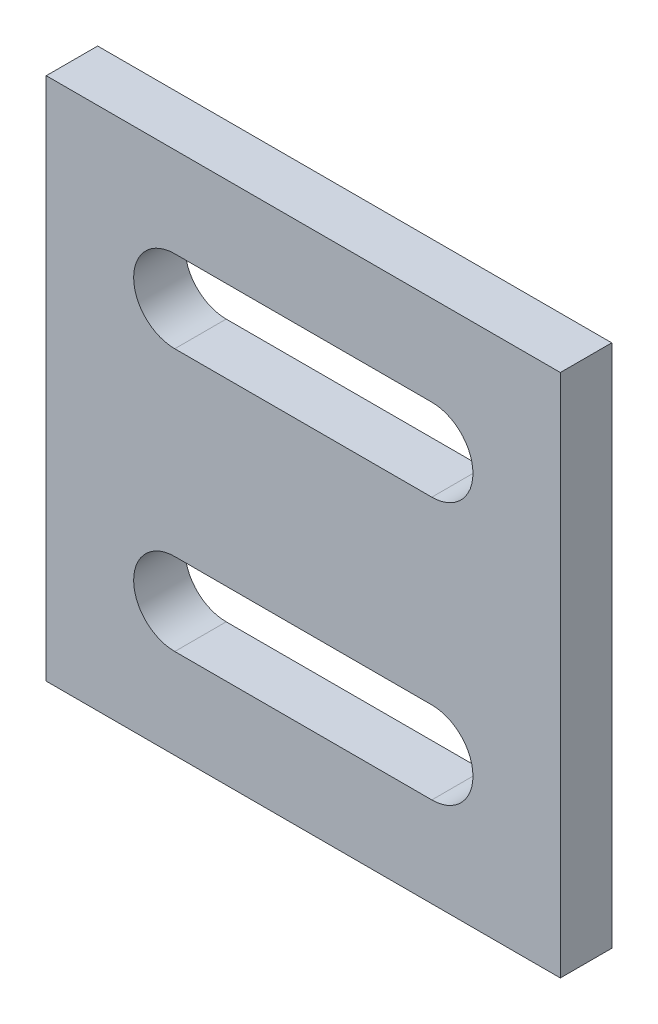
ISO-10303-21;
HEADER;
FILE_DESCRIPTION(('STEP AP214'),'2;1');
FILE_NAME('part.step','',(''),(''),'','','');
FILE_SCHEMA(('AUTOMOTIVE_DESIGN { 1 0 10303 214 1 1 1 1 }'));
ENDSEC;
DATA;
#1=APPLICATION_CONTEXT('core data for automotive mechanical design processes');
#2=APPLICATION_PROTOCOL_DEFINITION('international standard','automotive_design',2000,#1);
#3=PRODUCT_CONTEXT('',#1,'mechanical');
#4=PRODUCT('Part','Part','',(#3));
#5=PRODUCT_RELATED_PRODUCT_CATEGORY('part','',(#4));
#6=PRODUCT_DEFINITION_FORMATION('','',#4);
#7=PRODUCT_DEFINITION_CONTEXT('part definition',#1,'design');
#8=PRODUCT_DEFINITION('design','',#6,#7);
#9=PRODUCT_DEFINITION_SHAPE('','',#8);
#10=(LENGTH_UNIT() NAMED_UNIT(*) SI_UNIT(.MILLI.,.METRE.));
#11=(NAMED_UNIT(*) PLANE_ANGLE_UNIT() SI_UNIT($,.RADIAN.));
#12=(NAMED_UNIT(*) SI_UNIT($,.STERADIAN.) SOLID_ANGLE_UNIT());
#13=UNCERTAINTY_MEASURE_WITH_UNIT(LENGTH_MEASURE(1.E-05),#10,'distance_accuracy_value','');
#14=(GEOMETRIC_REPRESENTATION_CONTEXT(3) GLOBAL_UNCERTAINTY_ASSIGNED_CONTEXT((#13)) GLOBAL_UNIT_ASSIGNED_CONTEXT((#10,
#11,#12)) REPRESENTATION_CONTEXT('',''));
#15=CARTESIAN_POINT('',(0.,0.,0.));
#16=DIRECTION('',(0.,0.,1.));
#17=DIRECTION('',(1.,0.,0.));
#18=AXIS2_PLACEMENT_3D('',#15,#16,#17);
#19=CARTESIAN_POINT('',(0.,0.,2.));
#20=DIRECTION('',(0.,0.,1.));
#21=DIRECTION('',(1.,0.,0.));
#22=AXIS2_PLACEMENT_3D('',#19,#20,#21);
#23=PLANE('',#22);
#24=DIRECTION('',(0.,-1.,0.));
#25=VECTOR('',#24,1.);
#26=CARTESIAN_POINT('',(-18.1755180011164,18.3409622952862,2.));
#27=LINE('',#26,#25);
#28=CARTESIAN_POINT('',(-18.1755180011164,18.3409622952862,2.));
#29=VERTEX_POINT('',#28);
#30=CARTESIAN_POINT('',(-18.1755180011164,-2.05903770471384,2.));
#31=VERTEX_POINT('',#30);
#32=EDGE_CURVE('E224',#29,#31,#27,.T.);
#33=ORIENTED_EDGE('',*,*,#32,.T.);
#34=DIRECTION('',(1.,0.,0.));
#35=VECTOR('',#34,1.);
#36=CARTESIAN_POINT('',(-18.1755180011164,-2.05903770471384,2.));
#37=LINE('',#36,#35);
#38=CARTESIAN_POINT('',(1.82448199888361,-2.05903770471383,2.));
#39=VERTEX_POINT('',#38);
#40=EDGE_CURVE('E228',#31,#39,#37,.T.);
#41=ORIENTED_EDGE('',*,*,#40,.T.);
#42=DIRECTION('',(0.,1.,0.));
#43=VECTOR('',#42,1.);
#44=CARTESIAN_POINT('',(1.82448199888361,18.3409622952862,2.));
#45=LINE('',#44,#43);
#46=CARTESIAN_POINT('',(1.82448199888361,18.3409622952862,2.));
#47=VERTEX_POINT('',#46);
#48=EDGE_CURVE('E232',#39,#47,#45,.T.);
#49=ORIENTED_EDGE('',*,*,#48,.T.);
#50=DIRECTION('',(-1.,0.,0.));
#51=VECTOR('',#50,1.);
#52=CARTESIAN_POINT('',(-18.1755180011164,18.3409622952862,2.));
#53=LINE('',#52,#51);
#54=EDGE_CURVE('E235',#47,#29,#53,.T.);
#55=ORIENTED_EDGE('',*,*,#54,.T.);
#56=EDGE_LOOP('',(#33,#41,#49,#55));
#57=FACE_BOUND('',#56,.T.);
#58=DIRECTION('',(1.,0.,0.));
#59=VECTOR('',#58,1.);
#60=CARTESIAN_POINT('',(-13.1755180011164,11.6409622952862,2.));
#61=LINE('',#60,#59);
#62=CARTESIAN_POINT('',(-13.1755180011164,11.6409622952862,2.));
#63=VERTEX_POINT('',#62);
#64=CARTESIAN_POINT('',(-3.17551800111639,11.6409622952862,2.));
#65=VERTEX_POINT('',#64);
#66=EDGE_CURVE('E184',#63,#65,#61,.T.);
#67=ORIENTED_EDGE('',*,*,#66,.F.);
#68=CARTESIAN_POINT('',(-13.1755180011164,13.2409622952862,2.));
#69=DIRECTION('',(0.,0.,1.));
#70=DIRECTION('',(1.,0.,0.));
#71=AXIS2_PLACEMENT_3D('',#68,#69,#70);
#72=CIRCLE('',#71,1.6);
#73=CARTESIAN_POINT('',(-13.1755180011164,14.8409622952862,2.));
#74=VERTEX_POINT('',#73);
#75=EDGE_CURVE('E181',#74,#63,#72,.T.);
#76=ORIENTED_EDGE('',*,*,#75,.F.);
#77=DIRECTION('',(-1.,0.,0.));
#78=VECTOR('',#77,1.);
#79=CARTESIAN_POINT('',(-13.1755180011164,14.8409622952862,2.));
#80=LINE('',#79,#78);
#81=CARTESIAN_POINT('',(-3.17551800111639,14.8409622952862,2.));
#82=VERTEX_POINT('',#81);
#83=EDGE_CURVE('E192',#82,#74,#80,.T.);
#84=ORIENTED_EDGE('',*,*,#83,.F.);
#85=CARTESIAN_POINT('',(-3.17551800111639,13.2409622952862,2.));
#86=DIRECTION('',(0.,0.,1.));
#87=DIRECTION('',(1.,0.,0.));
#88=AXIS2_PLACEMENT_3D('',#85,#86,#87);
#89=CIRCLE('',#88,1.6);
#90=EDGE_CURVE('E188',#65,#82,#89,.T.);
#91=ORIENTED_EDGE('',*,*,#90,.F.);
#92=EDGE_LOOP('',(#67,#76,#84,#91));
#93=FACE_BOUND('',#92,.T.);
#94=DIRECTION('',(1.,0.,0.));
#95=VECTOR('',#94,1.);
#96=CARTESIAN_POINT('',(-13.1755180011164,1.44096229528616,2.));
#97=LINE('',#96,#95);
#98=CARTESIAN_POINT('',(-13.1755180011164,1.44096229528616,2.));
#99=VERTEX_POINT('',#98);
#100=CARTESIAN_POINT('',(-3.17551800111638,1.44096229528617,2.));
#101=VERTEX_POINT('',#100);
#102=EDGE_CURVE('E142',#99,#101,#97,.T.);
#103=ORIENTED_EDGE('',*,*,#102,.F.);
#104=CARTESIAN_POINT('',(-13.1755180011164,3.04096229528616,2.));
#105=DIRECTION('',(0.,0.,1.));
#106=DIRECTION('',(-1.,0.,0.));
#107=AXIS2_PLACEMENT_3D('',#104,#105,#106);
#108=CIRCLE('',#107,1.6);
#109=CARTESIAN_POINT('',(-13.1755180011164,4.64096229528616,2.));
#110=VERTEX_POINT('',#109);
#111=EDGE_CURVE('E133',#110,#99,#108,.T.);
#112=ORIENTED_EDGE('',*,*,#111,.F.);
#113=DIRECTION('',(-1.,0.,0.));
#114=VECTOR('',#113,1.);
#115=CARTESIAN_POINT('',(-13.1755180011164,4.64096229528616,2.));
#116=LINE('',#115,#114);
#117=CARTESIAN_POINT('',(-3.17551800111639,4.64096229528617,2.));
#118=VERTEX_POINT('',#117);
#119=EDGE_CURVE('E159',#118,#110,#116,.T.);
#120=ORIENTED_EDGE('',*,*,#119,.F.);
#121=CARTESIAN_POINT('',(-3.17551800111638,3.04096229528617,2.));
#122=DIRECTION('',(0.,0.,1.));
#123=DIRECTION('',(-1.,0.,0.));
#124=AXIS2_PLACEMENT_3D('',#121,#122,#123);
#125=CIRCLE('',#124,1.6);
#126=EDGE_CURVE('E155',#101,#118,#125,.T.);
#127=ORIENTED_EDGE('',*,*,#126,.F.);
#128=EDGE_LOOP('',(#103,#112,#120,#127));
#129=FACE_BOUND('',#128,.T.);
#130=ADVANCED_FACE('F43',(#57,#93,#129),#23,.T.);
#131=CARTESIAN_POINT('',(0.,0.,0.));
#132=DIRECTION('',(0.,0.,1.));
#133=DIRECTION('',(1.,0.,0.));
#134=AXIS2_PLACEMENT_3D('',#131,#132,#133);
#135=PLANE('',#134);
#136=CARTESIAN_POINT('',(-13.1755180011164,13.2409622952862,0.));
#137=DIRECTION('',(0.,0.,1.));
#138=DIRECTION('',(1.,0.,0.));
#139=AXIS2_PLACEMENT_3D('',#136,#137,#138);
#140=CIRCLE('',#139,1.6);
#141=CARTESIAN_POINT('',(-13.1755180011164,14.8409622952862,0.));
#142=VERTEX_POINT('',#141);
#143=CARTESIAN_POINT('',(-13.1755180011164,11.6409622952862,0.));
#144=VERTEX_POINT('',#143);
#145=EDGE_CURVE('E151',#142,#144,#140,.T.);
#146=ORIENTED_EDGE('',*,*,#145,.T.);
#147=DIRECTION('',(1.,0.,0.));
#148=VECTOR('',#147,1.);
#149=CARTESIAN_POINT('',(-13.1755180011164,11.6409622952862,0.));
#150=LINE('',#149,#148);
#151=CARTESIAN_POINT('',(-3.17551800111639,11.6409622952862,0.));
#152=VERTEX_POINT('',#151);
#153=EDGE_CURVE('E199',#144,#152,#150,.T.);
#154=ORIENTED_EDGE('',*,*,#153,.T.);
#155=CARTESIAN_POINT('',(-3.17551800111639,13.2409622952862,0.));
#156=DIRECTION('',(0.,0.,1.));
#157=DIRECTION('',(1.,0.,0.));
#158=AXIS2_PLACEMENT_3D('',#155,#156,#157);
#159=CIRCLE('',#158,1.6);
#160=CARTESIAN_POINT('',(-3.17551800111639,14.8409622952862,0.));
#161=VERTEX_POINT('',#160);
#162=EDGE_CURVE('E203',#152,#161,#159,.T.);
#163=ORIENTED_EDGE('',*,*,#162,.T.);
#164=DIRECTION('',(-1.,0.,0.));
#165=VECTOR('',#164,1.);
#166=CARTESIAN_POINT('',(-13.1755180011164,14.8409622952862,0.));
#167=LINE('',#166,#165);
#168=EDGE_CURVE('E185',#161,#142,#167,.T.);
#169=ORIENTED_EDGE('',*,*,#168,.T.);
#170=EDGE_LOOP('',(#146,#154,#163,#169));
#171=FACE_BOUND('',#170,.T.);
#172=DIRECTION('',(0.,-1.,0.));
#173=VECTOR('',#172,1.);
#174=CARTESIAN_POINT('',(-18.1755180011164,18.3409622952862,0.));
#175=LINE('',#174,#173);
#176=CARTESIAN_POINT('',(-18.1755180011164,18.3409622952862,0.));
#177=VERTEX_POINT('',#176);
#178=CARTESIAN_POINT('',(-18.1755180011164,-2.05903770471384,0.));
#179=VERTEX_POINT('',#178);
#180=EDGE_CURVE('E223',#177,#179,#175,.T.);
#181=ORIENTED_EDGE('',*,*,#180,.F.);
#182=DIRECTION('',(-1.,0.,0.));
#183=VECTOR('',#182,1.);
#184=CARTESIAN_POINT('',(-18.1755180011164,18.3409622952862,0.));
#185=LINE('',#184,#183);
#186=CARTESIAN_POINT('',(1.82448199888361,18.3409622952862,0.));
#187=VERTEX_POINT('',#186);
#188=EDGE_CURVE('E229',#187,#177,#185,.T.);
#189=ORIENTED_EDGE('',*,*,#188,.F.);
#190=DIRECTION('',(0.,1.,0.));
#191=VECTOR('',#190,1.);
#192=CARTESIAN_POINT('',(1.82448199888361,18.3409622952862,0.));
#193=LINE('',#192,#191);
#194=CARTESIAN_POINT('',(1.82448199888361,-2.05903770471383,0.));
#195=VERTEX_POINT('',#194);
#196=EDGE_CURVE('E245',#195,#187,#193,.T.);
#197=ORIENTED_EDGE('',*,*,#196,.F.);
#198=DIRECTION('',(1.,0.,0.));
#199=VECTOR('',#198,1.);
#200=CARTESIAN_POINT('',(-18.1755180011164,-2.05903770471384,0.));
#201=LINE('',#200,#199);
#202=EDGE_CURVE('E242',#179,#195,#201,.T.);
#203=ORIENTED_EDGE('',*,*,#202,.F.);
#204=EDGE_LOOP('',(#181,#189,#197,#203));
#205=FACE_BOUND('',#204,.T.);
#206=CARTESIAN_POINT('',(-13.1755180011164,3.04096229528616,0.));
#207=DIRECTION('',(0.,0.,1.));
#208=DIRECTION('',(-1.,0.,0.));
#209=AXIS2_PLACEMENT_3D('',#206,#207,#208);
#210=CIRCLE('',#209,1.6);
#211=CARTESIAN_POINT('',(-13.1755180011164,4.64096229528616,0.));
#212=VERTEX_POINT('',#211);
#213=CARTESIAN_POINT('',(-13.1755180011164,1.44096229528616,0.));
#214=VERTEX_POINT('',#213);
#215=EDGE_CURVE('E67',#212,#214,#210,.T.);
#216=ORIENTED_EDGE('',*,*,#215,.T.);
#217=DIRECTION('',(1.,0.,0.));
#218=VECTOR('',#217,1.);
#219=CARTESIAN_POINT('',(-13.1755180011164,1.44096229528616,0.));
#220=LINE('',#219,#218);
#221=CARTESIAN_POINT('',(-3.17551800111638,1.44096229528617,0.));
#222=VERTEX_POINT('',#221);
#223=EDGE_CURVE('E149',#214,#222,#220,.T.);
#224=ORIENTED_EDGE('',*,*,#223,.T.);
#225=CARTESIAN_POINT('',(-3.17551800111638,3.04096229528617,0.));
#226=DIRECTION('',(0.,0.,1.));
#227=DIRECTION('',(-1.,0.,0.));
#228=AXIS2_PLACEMENT_3D('',#225,#226,#227);
#229=CIRCLE('',#228,1.6);
#230=CARTESIAN_POINT('',(-3.17551800111639,4.64096229528617,0.));
#231=VERTEX_POINT('',#230);
#232=EDGE_CURVE('E168',#222,#231,#229,.T.);
#233=ORIENTED_EDGE('',*,*,#232,.T.);
#234=DIRECTION('',(-1.,0.,0.));
#235=VECTOR('',#234,1.);
#236=CARTESIAN_POINT('',(-13.1755180011164,4.64096229528616,0.));
#237=LINE('',#236,#235);
#238=EDGE_CURVE('E143',#231,#212,#237,.T.);
#239=ORIENTED_EDGE('',*,*,#238,.T.);
#240=EDGE_LOOP('',(#216,#224,#233,#239));
#241=FACE_BOUND('',#240,.T.);
#242=ADVANCED_FACE('F268',(#171,#205,#241),#135,.F.);
#243=CARTESIAN_POINT('',(-18.1755180011164,18.3409622952862,2.));
#244=DIRECTION('',(1.,0.,0.));
#245=DIRECTION('',(0.,0.,-1.));
#246=AXIS2_PLACEMENT_3D('',#243,#244,#245);
#247=PLANE('',#246);
#248=ORIENTED_EDGE('',*,*,#180,.T.);
#249=DIRECTION('',(0.,0.,-1.));
#250=VECTOR('',#249,1.);
#251=CARTESIAN_POINT('',(-18.1755180011164,-2.05903770471384,2.));
#252=LINE('',#251,#250);
#253=EDGE_CURVE('E11',#31,#179,#252,.T.);
#254=ORIENTED_EDGE('',*,*,#253,.F.);
#255=ORIENTED_EDGE('',*,*,#32,.F.);
#256=DIRECTION('',(0.,0.,-1.));
#257=VECTOR('',#256,1.);
#258=CARTESIAN_POINT('',(-18.1755180011164,18.3409622952862,2.));
#259=LINE('',#258,#257);
#260=EDGE_CURVE('E238',#29,#177,#259,.T.);
#261=ORIENTED_EDGE('',*,*,#260,.T.);
#262=EDGE_LOOP('',(#248,#254,#255,#261));
#263=FACE_BOUND('',#262,.T.);
#264=ADVANCED_FACE('F45',(#263),#247,.F.);
#265=CARTESIAN_POINT('',(-18.1755180011164,-2.05903770471384,2.));
#266=DIRECTION('',(0.,1.,0.));
#267=DIRECTION('',(-1.,0.,0.));
#268=AXIS2_PLACEMENT_3D('',#265,#266,#267);
#269=PLANE('',#268);
#270=ORIENTED_EDGE('',*,*,#202,.T.);
#271=DIRECTION('',(0.,0.,-1.));
#272=VECTOR('',#271,1.);
#273=CARTESIAN_POINT('',(1.82448199888361,-2.05903770471383,2.));
#274=LINE('',#273,#272);
#275=EDGE_CURVE('E52',#39,#195,#274,.T.);
#276=ORIENTED_EDGE('',*,*,#275,.F.);
#277=ORIENTED_EDGE('',*,*,#40,.F.);
#278=ORIENTED_EDGE('',*,*,#253,.T.);
#279=EDGE_LOOP('',(#270,#276,#277,#278));
#280=FACE_BOUND('',#279,.T.);
#281=ADVANCED_FACE('F279',(#280),#269,.F.);
#282=CARTESIAN_POINT('',(1.82448199888361,18.3409622952862,2.));
#283=DIRECTION('',(-1.,0.,0.));
#284=DIRECTION('',(0.,-1.,0.));
#285=AXIS2_PLACEMENT_3D('',#282,#283,#284);
#286=PLANE('',#285);
#287=ORIENTED_EDGE('',*,*,#196,.T.);
#288=DIRECTION('',(0.,0.,-1.));
#289=VECTOR('',#288,1.);
#290=CARTESIAN_POINT('',(1.82448199888361,18.3409622952862,2.));
#291=LINE('',#290,#289);
#292=EDGE_CURVE('E253',#47,#187,#291,.T.);
#293=ORIENTED_EDGE('',*,*,#292,.F.);
#294=ORIENTED_EDGE('',*,*,#48,.F.);
#295=ORIENTED_EDGE('',*,*,#275,.T.);
#296=EDGE_LOOP('',(#287,#293,#294,#295));
#297=FACE_BOUND('',#296,.T.);
#298=ADVANCED_FACE('F262',(#297),#286,.F.);
#299=CARTESIAN_POINT('',(-18.1755180011164,18.3409622952862,2.));
#300=DIRECTION('',(0.,-1.,0.));
#301=DIRECTION('',(1.,0.,0.));
#302=AXIS2_PLACEMENT_3D('',#299,#300,#301);
#303=PLANE('',#302);
#304=ORIENTED_EDGE('',*,*,#188,.T.);
#305=ORIENTED_EDGE('',*,*,#260,.F.);
#306=ORIENTED_EDGE('',*,*,#54,.F.);
#307=ORIENTED_EDGE('',*,*,#292,.T.);
#308=EDGE_LOOP('',(#304,#305,#306,#307));
#309=FACE_BOUND('',#308,.T.);
#310=ADVANCED_FACE('F272',(#309),#303,.F.);
#311=CARTESIAN_POINT('',(-13.1755180011164,13.2409622952862,2.));
#312=DIRECTION('',(0.,0.,-1.));
#313=DIRECTION('',(-1.,0.,0.));
#314=AXIS2_PLACEMENT_3D('',#311,#312,#313);
#315=CYLINDRICAL_SURFACE('',#314,1.6);
#316=ORIENTED_EDGE('',*,*,#145,.F.);
#317=DIRECTION('',(0.,0.,-1.));
#318=VECTOR('',#317,1.);
#319=CARTESIAN_POINT('',(-13.1755180011164,14.8409622952862,2.));
#320=LINE('',#319,#318);
#321=EDGE_CURVE('E195',#74,#142,#320,.T.);
#322=ORIENTED_EDGE('',*,*,#321,.F.);
#323=ORIENTED_EDGE('',*,*,#75,.T.);
#324=DIRECTION('',(0.,0.,-1.));
#325=VECTOR('',#324,1.);
#326=CARTESIAN_POINT('',(-13.1755180011164,11.6409622952862,2.));
#327=LINE('',#326,#325);
#328=EDGE_CURVE('E219',#63,#144,#327,.T.);
#329=ORIENTED_EDGE('',*,*,#328,.T.);
#330=EDGE_LOOP('',(#316,#322,#323,#329));
#331=FACE_BOUND('',#330,.T.);
#332=ADVANCED_FACE('F294',(#331),#315,.F.);
#333=CARTESIAN_POINT('',(-13.1755180011164,11.6409622952862,2.));
#334=DIRECTION('',(0.,1.,0.));
#335=DIRECTION('',(-1.,0.,0.));
#336=AXIS2_PLACEMENT_3D('',#333,#334,#335);
#337=PLANE('',#336);
#338=ORIENTED_EDGE('',*,*,#153,.F.);
#339=ORIENTED_EDGE('',*,*,#328,.F.);
#340=ORIENTED_EDGE('',*,*,#66,.T.);
#341=DIRECTION('',(0.,0.,-1.));
#342=VECTOR('',#341,1.);
#343=CARTESIAN_POINT('',(-3.17551800111639,11.6409622952862,2.));
#344=LINE('',#343,#342);
#345=EDGE_CURVE('E216',#65,#152,#344,.T.);
#346=ORIENTED_EDGE('',*,*,#345,.T.);
#347=EDGE_LOOP('',(#338,#339,#340,#346));
#348=FACE_BOUND('',#347,.T.);
#349=ADVANCED_FACE('F301',(#348),#337,.T.);
#350=CARTESIAN_POINT('',(-3.17551800111639,13.2409622952862,2.));
#351=DIRECTION('',(0.,0.,-1.));
#352=DIRECTION('',(-1.,0.,0.));
#353=AXIS2_PLACEMENT_3D('',#350,#351,#352);
#354=CYLINDRICAL_SURFACE('',#353,1.6);
#355=ORIENTED_EDGE('',*,*,#162,.F.);
#356=ORIENTED_EDGE('',*,*,#345,.F.);
#357=ORIENTED_EDGE('',*,*,#90,.T.);
#358=DIRECTION('',(0.,0.,-1.));
#359=VECTOR('',#358,1.);
#360=CARTESIAN_POINT('',(-3.17551800111639,14.8409622952862,2.));
#361=LINE('',#360,#359);
#362=EDGE_CURVE('E213',#82,#161,#361,.T.);
#363=ORIENTED_EDGE('',*,*,#362,.T.);
#364=EDGE_LOOP('',(#355,#356,#357,#363));
#365=FACE_BOUND('',#364,.T.);
#366=ADVANCED_FACE('F306',(#365),#354,.F.);
#367=CARTESIAN_POINT('',(-13.1755180011164,14.8409622952862,2.));
#368=DIRECTION('',(0.,-1.,0.));
#369=DIRECTION('',(1.,0.,0.));
#370=AXIS2_PLACEMENT_3D('',#367,#368,#369);
#371=PLANE('',#370);
#372=ORIENTED_EDGE('',*,*,#168,.F.);
#373=ORIENTED_EDGE('',*,*,#362,.F.);
#374=ORIENTED_EDGE('',*,*,#83,.T.);
#375=ORIENTED_EDGE('',*,*,#321,.T.);
#376=EDGE_LOOP('',(#372,#373,#374,#375));
#377=FACE_BOUND('',#376,.T.);
#378=ADVANCED_FACE('F313',(#377),#371,.T.);
#379=CARTESIAN_POINT('',(-13.1755180011164,3.04096229528616,2.));
#380=DIRECTION('',(0.,0.,-1.));
#381=DIRECTION('',(-1.,0.,0.));
#382=AXIS2_PLACEMENT_3D('',#379,#380,#381);
#383=CYLINDRICAL_SURFACE('',#382,1.6);
#384=ORIENTED_EDGE('',*,*,#215,.F.);
#385=DIRECTION('',(0.,0.,-1.));
#386=VECTOR('',#385,1.);
#387=CARTESIAN_POINT('',(-13.1755180011164,4.64096229528616,2.));
#388=LINE('',#387,#386);
#389=EDGE_CURVE('E137',#110,#212,#388,.T.);
#390=ORIENTED_EDGE('',*,*,#389,.F.);
#391=ORIENTED_EDGE('',*,*,#111,.T.);
#392=DIRECTION('',(0.,0.,-1.));
#393=VECTOR('',#392,1.);
#394=CARTESIAN_POINT('',(-13.1755180011164,1.44096229528616,2.));
#395=LINE('',#394,#393);
#396=EDGE_CURVE('E136',#99,#214,#395,.T.);
#397=ORIENTED_EDGE('',*,*,#396,.T.);
#398=EDGE_LOOP('',(#384,#390,#391,#397));
#399=FACE_BOUND('',#398,.T.);
#400=ADVANCED_FACE('F135',(#399),#383,.F.);
#401=CARTESIAN_POINT('',(-13.1755180011164,1.44096229528616,2.));
#402=DIRECTION('',(0.,1.,0.));
#403=DIRECTION('',(-1.,0.,0.));
#404=AXIS2_PLACEMENT_3D('',#401,#402,#403);
#405=PLANE('',#404);
#406=ORIENTED_EDGE('',*,*,#223,.F.);
#407=ORIENTED_EDGE('',*,*,#396,.F.);
#408=ORIENTED_EDGE('',*,*,#102,.T.);
#409=DIRECTION('',(0.,0.,-1.));
#410=VECTOR('',#409,1.);
#411=CARTESIAN_POINT('',(-3.17551800111638,1.44096229528617,2.));
#412=LINE('',#411,#410);
#413=EDGE_CURVE('E152',#101,#222,#412,.T.);
#414=ORIENTED_EDGE('',*,*,#413,.T.);
#415=EDGE_LOOP('',(#406,#407,#408,#414));
#416=FACE_BOUND('',#415,.T.);
#417=ADVANCED_FACE('F146',(#416),#405,.T.);
#418=CARTESIAN_POINT('',(-3.17551800111638,3.04096229528617,2.));
#419=DIRECTION('',(0.,0.,-1.));
#420=DIRECTION('',(-1.,0.,0.));
#421=AXIS2_PLACEMENT_3D('',#418,#419,#420);
#422=CYLINDRICAL_SURFACE('',#421,1.6);
#423=ORIENTED_EDGE('',*,*,#232,.F.);
#424=ORIENTED_EDGE('',*,*,#413,.F.);
#425=ORIENTED_EDGE('',*,*,#126,.T.);
#426=DIRECTION('',(0.,0.,-1.));
#427=VECTOR('',#426,1.);
#428=CARTESIAN_POINT('',(-3.17551800111639,4.64096229528617,2.));
#429=LINE('',#428,#427);
#430=EDGE_CURVE('E59',#118,#231,#429,.T.);
#431=ORIENTED_EDGE('',*,*,#430,.T.);
#432=EDGE_LOOP('',(#423,#424,#425,#431));
#433=FACE_BOUND('',#432,.T.);
#434=ADVANCED_FACE('F331',(#433),#422,.F.);
#435=CARTESIAN_POINT('',(-13.1755180011164,4.64096229528616,2.));
#436=DIRECTION('',(0.,-1.,0.));
#437=DIRECTION('',(1.,0.,0.));
#438=AXIS2_PLACEMENT_3D('',#435,#436,#437);
#439=PLANE('',#438);
#440=ORIENTED_EDGE('',*,*,#238,.F.);
#441=ORIENTED_EDGE('',*,*,#430,.F.);
#442=ORIENTED_EDGE('',*,*,#119,.T.);
#443=ORIENTED_EDGE('',*,*,#389,.T.);
#444=EDGE_LOOP('',(#440,#441,#442,#443));
#445=FACE_BOUND('',#444,.T.);
#446=ADVANCED_FACE('F334',(#445),#439,.T.);
#447=CLOSED_SHELL('',(#130,#242,#264,#281,#298,#310,#332,#349,#366,#378,#400,#417,#434,#446));
#448=MANIFOLD_SOLID_BREP('B2',#447);
#449=ADVANCED_BREP_SHAPE_REPRESENTATION('',(#18,#448),#14);
#450=SHAPE_DEFINITION_REPRESENTATION(#9,#449);
ENDSEC;
END-ISO-10303-21;
